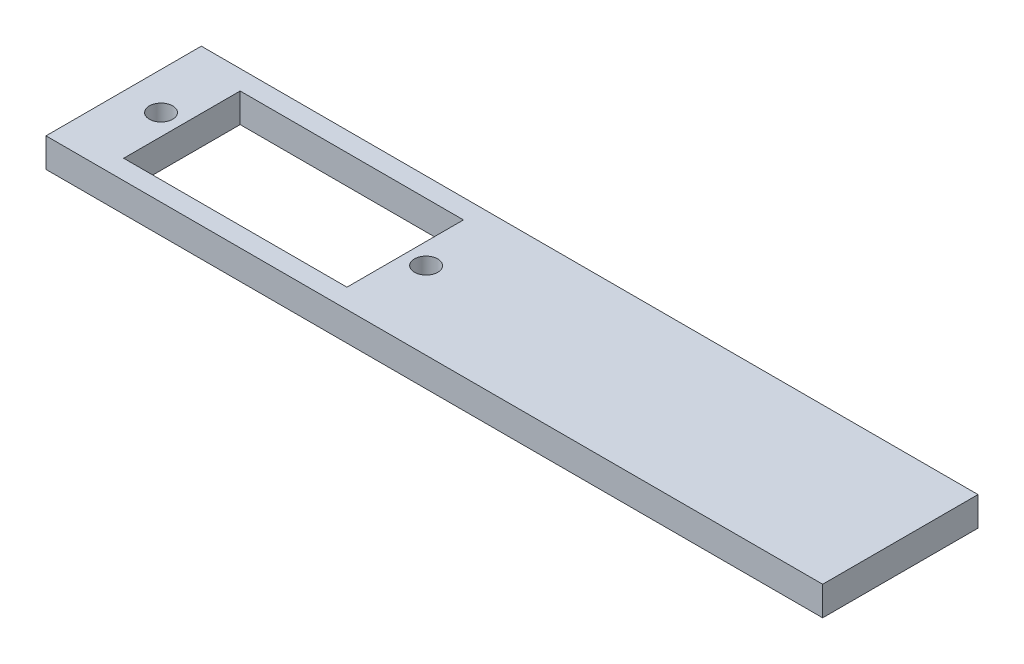
ISO-10303-21;
HEADER;
FILE_DESCRIPTION(('STEP AP214'),'2;1');
FILE_NAME('part.step','',(''),(''),'','','');
FILE_SCHEMA(('AUTOMOTIVE_DESIGN { 1 0 10303 214 1 1 1 1 }'));
ENDSEC;
DATA;
#1=APPLICATION_CONTEXT('core data for automotive mechanical design processes');
#2=APPLICATION_PROTOCOL_DEFINITION('international standard','automotive_design',2000,#1);
#3=PRODUCT_CONTEXT('',#1,'mechanical');
#4=PRODUCT('Part','Part','',(#3));
#5=PRODUCT_RELATED_PRODUCT_CATEGORY('part','',(#4));
#6=PRODUCT_DEFINITION_FORMATION('','',#4);
#7=PRODUCT_DEFINITION_CONTEXT('part definition',#1,'design');
#8=PRODUCT_DEFINITION('design','',#6,#7);
#9=PRODUCT_DEFINITION_SHAPE('','',#8);
#10=(LENGTH_UNIT() NAMED_UNIT(*) SI_UNIT(.MILLI.,.METRE.));
#11=(NAMED_UNIT(*) PLANE_ANGLE_UNIT() SI_UNIT($,.RADIAN.));
#12=(NAMED_UNIT(*) SI_UNIT($,.STERADIAN.) SOLID_ANGLE_UNIT());
#13=UNCERTAINTY_MEASURE_WITH_UNIT(LENGTH_MEASURE(1.E-05),#10,'distance_accuracy_value','');
#14=(GEOMETRIC_REPRESENTATION_CONTEXT(3) GLOBAL_UNCERTAINTY_ASSIGNED_CONTEXT((#13)) GLOBAL_UNIT_ASSIGNED_CONTEXT((#10,
#11,#12)) REPRESENTATION_CONTEXT('',''));
#15=CARTESIAN_POINT('',(0.,0.,0.));
#16=DIRECTION('',(0.,0.,1.));
#17=DIRECTION('',(1.,0.,0.));
#18=AXIS2_PLACEMENT_3D('',#15,#16,#17);
#19=CARTESIAN_POINT('',(40.,3.,8.));
#20=DIRECTION('',(-1.,0.,0.));
#21=DIRECTION('',(0.,0.,1.));
#22=AXIS2_PLACEMENT_3D('',#19,#20,#21);
#23=PLANE('',#22);
#24=DIRECTION('',(0.,0.,-1.));
#25=VECTOR('',#24,1.);
#26=CARTESIAN_POINT('',(40.,0.,8.));
#27=LINE('',#26,#25);
#28=CARTESIAN_POINT('',(40.,0.,8.));
#29=VERTEX_POINT('',#28);
#30=CARTESIAN_POINT('',(40.,0.,-8.));
#31=VERTEX_POINT('',#30);
#32=EDGE_CURVE('E134',#29,#31,#27,.T.);
#33=ORIENTED_EDGE('',*,*,#32,.T.);
#34=DIRECTION('',(0.,-1.,0.));
#35=VECTOR('',#34,1.);
#36=CARTESIAN_POINT('',(40.,3.,-8.));
#37=LINE('',#36,#35);
#38=CARTESIAN_POINT('',(40.,3.,-8.));
#39=VERTEX_POINT('',#38);
#40=EDGE_CURVE('E11',#39,#31,#37,.T.);
#41=ORIENTED_EDGE('',*,*,#40,.F.);
#42=DIRECTION('',(0.,0.,-1.));
#43=VECTOR('',#42,1.);
#44=CARTESIAN_POINT('',(40.,3.,8.));
#45=LINE('',#44,#43);
#46=CARTESIAN_POINT('',(40.,3.,8.));
#47=VERTEX_POINT('',#46);
#48=EDGE_CURVE('E138',#47,#39,#45,.T.);
#49=ORIENTED_EDGE('',*,*,#48,.F.);
#50=DIRECTION('',(0.,-1.,0.));
#51=VECTOR('',#50,1.);
#52=CARTESIAN_POINT('',(40.,3.,8.));
#53=LINE('',#52,#51);
#54=EDGE_CURVE('E148',#47,#29,#53,.T.);
#55=ORIENTED_EDGE('',*,*,#54,.T.);
#56=EDGE_LOOP('',(#33,#41,#49,#55));
#57=FACE_BOUND('',#56,.T.);
#58=ADVANCED_FACE('F33',(#57),#23,.F.);
#59=CARTESIAN_POINT('',(-40.,3.,-8.));
#60=DIRECTION('',(0.,0.,1.));
#61=DIRECTION('',(1.,0.,0.));
#62=AXIS2_PLACEMENT_3D('',#59,#60,#61);
#63=PLANE('',#62);
#64=DIRECTION('',(-1.,0.,0.));
#65=VECTOR('',#64,1.);
#66=CARTESIAN_POINT('',(-40.,0.,-8.));
#67=LINE('',#66,#65);
#68=CARTESIAN_POINT('',(-40.,0.,-8.));
#69=VERTEX_POINT('',#68);
#70=EDGE_CURVE('E151',#31,#69,#67,.T.);
#71=ORIENTED_EDGE('',*,*,#70,.T.);
#72=DIRECTION('',(0.,-1.,0.));
#73=VECTOR('',#72,1.);
#74=CARTESIAN_POINT('',(-40.,3.,-8.));
#75=LINE('',#74,#73);
#76=CARTESIAN_POINT('',(-40.,3.,-8.));
#77=VERTEX_POINT('',#76);
#78=EDGE_CURVE('E40',#77,#69,#75,.T.);
#79=ORIENTED_EDGE('',*,*,#78,.F.);
#80=DIRECTION('',(-1.,0.,0.));
#81=VECTOR('',#80,1.);
#82=CARTESIAN_POINT('',(-40.,3.,-8.));
#83=LINE('',#82,#81);
#84=EDGE_CURVE('E141',#39,#77,#83,.T.);
#85=ORIENTED_EDGE('',*,*,#84,.F.);
#86=ORIENTED_EDGE('',*,*,#40,.T.);
#87=EDGE_LOOP('',(#71,#79,#85,#86));
#88=FACE_BOUND('',#87,.T.);
#89=ADVANCED_FACE('F179',(#88),#63,.F.);
#90=CARTESIAN_POINT('',(-40.,3.,8.));
#91=DIRECTION('',(1.,0.,0.));
#92=DIRECTION('',(0.,0.,-1.));
#93=AXIS2_PLACEMENT_3D('',#90,#91,#92);
#94=PLANE('',#93);
#95=DIRECTION('',(0.,0.,1.));
#96=VECTOR('',#95,1.);
#97=CARTESIAN_POINT('',(-40.,0.,8.));
#98=LINE('',#97,#96);
#99=CARTESIAN_POINT('',(-40.,0.,8.));
#100=VERTEX_POINT('',#99);
#101=EDGE_CURVE('E153',#69,#100,#98,.T.);
#102=ORIENTED_EDGE('',*,*,#101,.T.);
#103=DIRECTION('',(0.,-1.,0.));
#104=VECTOR('',#103,1.);
#105=CARTESIAN_POINT('',(-40.,3.,8.));
#106=LINE('',#105,#104);
#107=CARTESIAN_POINT('',(-40.,3.,8.));
#108=VERTEX_POINT('',#107);
#109=EDGE_CURVE('E158',#108,#100,#106,.T.);
#110=ORIENTED_EDGE('',*,*,#109,.F.);
#111=DIRECTION('',(0.,0.,1.));
#112=VECTOR('',#111,1.);
#113=CARTESIAN_POINT('',(-40.,3.,8.));
#114=LINE('',#113,#112);
#115=EDGE_CURVE('E144',#77,#108,#114,.T.);
#116=ORIENTED_EDGE('',*,*,#115,.F.);
#117=ORIENTED_EDGE('',*,*,#78,.T.);
#118=EDGE_LOOP('',(#102,#110,#116,#117));
#119=FACE_BOUND('',#118,.T.);
#120=ADVANCED_FACE('F165',(#119),#94,.F.);
#121=CARTESIAN_POINT('',(-40.,3.,8.));
#122=DIRECTION('',(0.,0.,-1.));
#123=DIRECTION('',(-1.,0.,0.));
#124=AXIS2_PLACEMENT_3D('',#121,#122,#123);
#125=PLANE('',#124);
#126=DIRECTION('',(1.,0.,0.));
#127=VECTOR('',#126,1.);
#128=CARTESIAN_POINT('',(-40.,0.,8.));
#129=LINE('',#128,#127);
#130=EDGE_CURVE('E142',#100,#29,#129,.T.);
#131=ORIENTED_EDGE('',*,*,#130,.T.);
#132=ORIENTED_EDGE('',*,*,#54,.F.);
#133=DIRECTION('',(1.,0.,0.));
#134=VECTOR('',#133,1.);
#135=CARTESIAN_POINT('',(-40.,3.,8.));
#136=LINE('',#135,#134);
#137=EDGE_CURVE('E146',#108,#47,#136,.T.);
#138=ORIENTED_EDGE('',*,*,#137,.F.);
#139=ORIENTED_EDGE('',*,*,#109,.T.);
#140=EDGE_LOOP('',(#131,#132,#138,#139));
#141=FACE_BOUND('',#140,.T.);
#142=ADVANCED_FACE('F172',(#141),#125,.F.);
#143=CARTESIAN_POINT('',(0.,3.,0.));
#144=DIRECTION('',(0.,-1.,0.));
#145=DIRECTION('',(0.,0.,-1.));
#146=AXIS2_PLACEMENT_3D('',#143,#144,#145);
#147=PLANE('',#146);
#148=CARTESIAN_POINT('',(-8.85,3.,0.));
#149=DIRECTION('',(0.,1.,0.));
#150=DIRECTION('',(0.,0.,1.));
#151=AXIS2_PLACEMENT_3D('',#148,#149,#150);
#152=CIRCLE('',#151,1.2);
#153=CARTESIAN_POINT('',(-8.85,3.,1.2));
#154=VERTEX_POINT('',#153);
#155=EDGE_CURVE('E121',#154,#154,#152,.T.);
#156=ORIENTED_EDGE('',*,*,#155,.F.);
#157=EDGE_LOOP('',(#156));
#158=FACE_BOUND('',#157,.T.);
#159=CARTESIAN_POINT('',(-36.15,3.,0.));
#160=DIRECTION('',(0.,1.,0.));
#161=DIRECTION('',(0.,0.,1.));
#162=AXIS2_PLACEMENT_3D('',#159,#160,#161);
#163=CIRCLE('',#162,1.2);
#164=CARTESIAN_POINT('',(-36.15,3.,1.2));
#165=VERTEX_POINT('',#164);
#166=EDGE_CURVE('E220',#165,#165,#163,.T.);
#167=ORIENTED_EDGE('',*,*,#166,.F.);
#168=EDGE_LOOP('',(#167));
#169=FACE_BOUND('',#168,.T.);
#170=DIRECTION('',(-1.,0.,0.));
#171=VECTOR('',#170,1.);
#172=CARTESIAN_POINT('',(-34.,3.,-6.));
#173=LINE('',#172,#171);
#174=CARTESIAN_POINT('',(-11.,3.,-6.));
#175=VERTEX_POINT('',#174);
#176=CARTESIAN_POINT('',(-34.,3.,-6.));
#177=VERTEX_POINT('',#176);
#178=EDGE_CURVE('E127',#175,#177,#173,.T.);
#179=ORIENTED_EDGE('',*,*,#178,.F.);
#180=DIRECTION('',(0.,0.,-1.));
#181=VECTOR('',#180,1.);
#182=CARTESIAN_POINT('',(-11.,3.,6.));
#183=LINE('',#182,#181);
#184=CARTESIAN_POINT('',(-11.,3.,6.));
#185=VERTEX_POINT('',#184);
#186=EDGE_CURVE('E47',#185,#175,#183,.T.);
#187=ORIENTED_EDGE('',*,*,#186,.F.);
#188=DIRECTION('',(1.,0.,0.));
#189=VECTOR('',#188,1.);
#190=CARTESIAN_POINT('',(-34.,3.,6.));
#191=LINE('',#190,#189);
#192=CARTESIAN_POINT('',(-34.,3.,6.));
#193=VERTEX_POINT('',#192);
#194=EDGE_CURVE('E115',#193,#185,#191,.T.);
#195=ORIENTED_EDGE('',*,*,#194,.F.);
#196=DIRECTION('',(0.,0.,1.));
#197=VECTOR('',#196,1.);
#198=CARTESIAN_POINT('',(-34.,3.,6.));
#199=LINE('',#198,#197);
#200=EDGE_CURVE('E118',#177,#193,#199,.T.);
#201=ORIENTED_EDGE('',*,*,#200,.F.);
#202=EDGE_LOOP('',(#179,#187,#195,#201));
#203=FACE_BOUND('',#202,.T.);
#204=ORIENTED_EDGE('',*,*,#48,.T.);
#205=ORIENTED_EDGE('',*,*,#84,.T.);
#206=ORIENTED_EDGE('',*,*,#115,.T.);
#207=ORIENTED_EDGE('',*,*,#137,.T.);
#208=EDGE_LOOP('',(#204,#205,#206,#207));
#209=FACE_BOUND('',#208,.T.);
#210=ADVANCED_FACE('F178',(#158,#169,#203,#209),#147,.F.);
#211=CARTESIAN_POINT('',(0.,0.,0.));
#212=DIRECTION('',(0.,-1.,0.));
#213=DIRECTION('',(0.,0.,-1.));
#214=AXIS2_PLACEMENT_3D('',#211,#212,#213);
#215=PLANE('',#214);
#216=CARTESIAN_POINT('',(-8.85,0.,0.));
#217=DIRECTION('',(0.,1.,0.));
#218=DIRECTION('',(0.,0.,1.));
#219=AXIS2_PLACEMENT_3D('',#216,#217,#218);
#220=CIRCLE('',#219,1.2);
#221=CARTESIAN_POINT('',(-8.85,0.,1.2));
#222=VERTEX_POINT('',#221);
#223=EDGE_CURVE('E222',#222,#222,#220,.T.);
#224=ORIENTED_EDGE('',*,*,#223,.T.);
#225=EDGE_LOOP('',(#224));
#226=FACE_BOUND('',#225,.T.);
#227=CARTESIAN_POINT('',(-36.15,0.,0.));
#228=DIRECTION('',(0.,1.,0.));
#229=DIRECTION('',(0.,0.,1.));
#230=AXIS2_PLACEMENT_3D('',#227,#228,#229);
#231=CIRCLE('',#230,1.2);
#232=CARTESIAN_POINT('',(-36.15,0.,1.2));
#233=VERTEX_POINT('',#232);
#234=EDGE_CURVE('E128',#233,#233,#231,.T.);
#235=ORIENTED_EDGE('',*,*,#234,.T.);
#236=EDGE_LOOP('',(#235));
#237=FACE_BOUND('',#236,.T.);
#238=DIRECTION('',(0.,0.,-1.));
#239=VECTOR('',#238,1.);
#240=CARTESIAN_POINT('',(-11.,0.,6.));
#241=LINE('',#240,#239);
#242=CARTESIAN_POINT('',(-11.,0.,6.));
#243=VERTEX_POINT('',#242);
#244=CARTESIAN_POINT('',(-11.,0.,-6.));
#245=VERTEX_POINT('',#244);
#246=EDGE_CURVE('E99',#243,#245,#241,.T.);
#247=ORIENTED_EDGE('',*,*,#246,.T.);
#248=DIRECTION('',(-1.,0.,0.));
#249=VECTOR('',#248,1.);
#250=CARTESIAN_POINT('',(-34.,0.,-6.));
#251=LINE('',#250,#249);
#252=CARTESIAN_POINT('',(-34.,0.,-6.));
#253=VERTEX_POINT('',#252);
#254=EDGE_CURVE('E108',#245,#253,#251,.T.);
#255=ORIENTED_EDGE('',*,*,#254,.T.);
#256=DIRECTION('',(0.,0.,1.));
#257=VECTOR('',#256,1.);
#258=CARTESIAN_POINT('',(-34.,0.,6.));
#259=LINE('',#258,#257);
#260=CARTESIAN_POINT('',(-34.,0.,6.));
#261=VERTEX_POINT('',#260);
#262=EDGE_CURVE('E55',#253,#261,#259,.T.);
#263=ORIENTED_EDGE('',*,*,#262,.T.);
#264=DIRECTION('',(1.,0.,0.));
#265=VECTOR('',#264,1.);
#266=CARTESIAN_POINT('',(-34.,0.,6.));
#267=LINE('',#266,#265);
#268=EDGE_CURVE('E105',#261,#243,#267,.T.);
#269=ORIENTED_EDGE('',*,*,#268,.T.);
#270=EDGE_LOOP('',(#247,#255,#263,#269));
#271=FACE_BOUND('',#270,.T.);
#272=ORIENTED_EDGE('',*,*,#32,.F.);
#273=ORIENTED_EDGE('',*,*,#130,.F.);
#274=ORIENTED_EDGE('',*,*,#101,.F.);
#275=ORIENTED_EDGE('',*,*,#70,.F.);
#276=EDGE_LOOP('',(#272,#273,#274,#275));
#277=FACE_BOUND('',#276,.T.);
#278=ADVANCED_FACE('F112',(#226,#237,#271,#277),#215,.T.);
#279=CARTESIAN_POINT('',(-11.,0.,6.));
#280=DIRECTION('',(1.,0.,0.));
#281=DIRECTION('',(0.,0.,-1.));
#282=AXIS2_PLACEMENT_3D('',#279,#280,#281);
#283=PLANE('',#282);
#284=ORIENTED_EDGE('',*,*,#186,.T.);
#285=DIRECTION('',(0.,1.,0.));
#286=VECTOR('',#285,1.);
#287=CARTESIAN_POINT('',(-11.,0.,-6.));
#288=LINE('',#287,#286);
#289=EDGE_CURVE('E95',#245,#175,#288,.T.);
#290=ORIENTED_EDGE('',*,*,#289,.F.);
#291=ORIENTED_EDGE('',*,*,#246,.F.);
#292=DIRECTION('',(0.,1.,0.));
#293=VECTOR('',#292,1.);
#294=CARTESIAN_POINT('',(-11.,0.,6.));
#295=LINE('',#294,#293);
#296=EDGE_CURVE('E132',#243,#185,#295,.T.);
#297=ORIENTED_EDGE('',*,*,#296,.T.);
#298=EDGE_LOOP('',(#284,#290,#291,#297));
#299=FACE_BOUND('',#298,.T.);
#300=ADVANCED_FACE('F97',(#299),#283,.F.);
#301=CARTESIAN_POINT('',(-34.,0.,6.));
#302=DIRECTION('',(0.,0.,1.));
#303=DIRECTION('',(1.,0.,0.));
#304=AXIS2_PLACEMENT_3D('',#301,#302,#303);
#305=PLANE('',#304);
#306=ORIENTED_EDGE('',*,*,#194,.T.);
#307=ORIENTED_EDGE('',*,*,#296,.F.);
#308=ORIENTED_EDGE('',*,*,#268,.F.);
#309=DIRECTION('',(0.,1.,0.));
#310=VECTOR('',#309,1.);
#311=CARTESIAN_POINT('',(-34.,0.,6.));
#312=LINE('',#311,#310);
#313=EDGE_CURVE('E135',#261,#193,#312,.T.);
#314=ORIENTED_EDGE('',*,*,#313,.T.);
#315=EDGE_LOOP('',(#306,#307,#308,#314));
#316=FACE_BOUND('',#315,.T.);
#317=ADVANCED_FACE('F197',(#316),#305,.F.);
#318=CARTESIAN_POINT('',(-34.,0.,6.));
#319=DIRECTION('',(-1.,0.,0.));
#320=DIRECTION('',(0.,0.,1.));
#321=AXIS2_PLACEMENT_3D('',#318,#319,#320);
#322=PLANE('',#321);
#323=ORIENTED_EDGE('',*,*,#200,.T.);
#324=ORIENTED_EDGE('',*,*,#313,.F.);
#325=ORIENTED_EDGE('',*,*,#262,.F.);
#326=DIRECTION('',(0.,1.,0.));
#327=VECTOR('',#326,1.);
#328=CARTESIAN_POINT('',(-34.,0.,-6.));
#329=LINE('',#328,#327);
#330=EDGE_CURVE('E104',#253,#177,#329,.T.);
#331=ORIENTED_EDGE('',*,*,#330,.T.);
#332=EDGE_LOOP('',(#323,#324,#325,#331));
#333=FACE_BOUND('',#332,.T.);
#334=ADVANCED_FACE('F201',(#333),#322,.F.);
#335=CARTESIAN_POINT('',(-34.,0.,-6.));
#336=DIRECTION('',(0.,0.,-1.));
#337=DIRECTION('',(-1.,0.,0.));
#338=AXIS2_PLACEMENT_3D('',#335,#336,#337);
#339=PLANE('',#338);
#340=ORIENTED_EDGE('',*,*,#178,.T.);
#341=ORIENTED_EDGE('',*,*,#330,.F.);
#342=ORIENTED_EDGE('',*,*,#254,.F.);
#343=ORIENTED_EDGE('',*,*,#289,.T.);
#344=EDGE_LOOP('',(#340,#341,#342,#343));
#345=FACE_BOUND('',#344,.T.);
#346=ADVANCED_FACE('F109',(#345),#339,.F.);
#347=CARTESIAN_POINT('',(-36.15,0.,0.));
#348=DIRECTION('',(0.,1.,0.));
#349=DIRECTION('',(0.,0.,1.));
#350=AXIS2_PLACEMENT_3D('',#347,#348,#349);
#351=CYLINDRICAL_SURFACE('',#350,1.2);
#352=ORIENTED_EDGE('',*,*,#234,.F.);
#353=EDGE_LOOP('',(#352));
#354=FACE_BOUND('',#353,.T.);
#355=ORIENTED_EDGE('',*,*,#166,.T.);
#356=EDGE_LOOP('',(#355));
#357=FACE_BOUND('',#356,.T.);
#358=ADVANCED_FACE('F200',(#354,#357),#351,.F.);
#359=CARTESIAN_POINT('',(-8.85,0.,0.));
#360=DIRECTION('',(0.,1.,0.));
#361=DIRECTION('',(0.,0.,1.));
#362=AXIS2_PLACEMENT_3D('',#359,#360,#361);
#363=CYLINDRICAL_SURFACE('',#362,1.2);
#364=ORIENTED_EDGE('',*,*,#223,.F.);
#365=EDGE_LOOP('',(#364));
#366=FACE_BOUND('',#365,.T.);
#367=ORIENTED_EDGE('',*,*,#155,.T.);
#368=EDGE_LOOP('',(#367));
#369=FACE_BOUND('',#368,.T.);
#370=ADVANCED_FACE('F207',(#366,#369),#363,.F.);
#371=CLOSED_SHELL('',(#58,#89,#120,#142,#210,#278,#300,#317,#334,#346,#358,#370));
#372=MANIFOLD_SOLID_BREP('B2',#371);
#373=ADVANCED_BREP_SHAPE_REPRESENTATION('',(#18,#372),#14);
#374=SHAPE_DEFINITION_REPRESENTATION(#9,#373);
ENDSEC;
END-ISO-10303-21;
